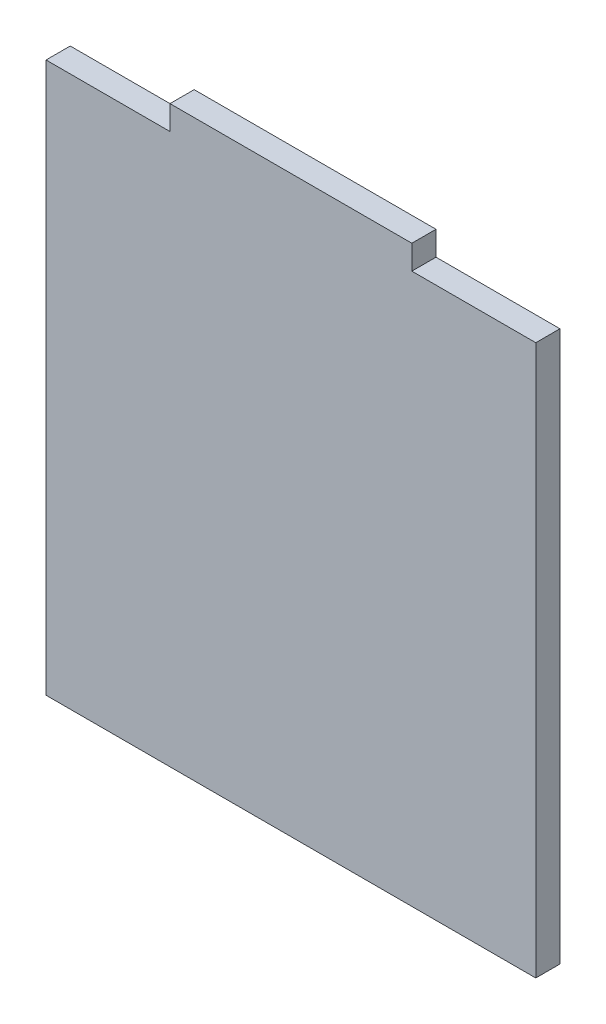
ISO-10303-21;
HEADER;
FILE_DESCRIPTION(('STEP AP214'),'2;1');
FILE_NAME('part.step','',(''),(''),'','','');
FILE_SCHEMA(('AUTOMOTIVE_DESIGN { 1 0 10303 214 1 1 1 1 }'));
ENDSEC;
DATA;
#1=APPLICATION_CONTEXT('core data for automotive mechanical design processes');
#2=APPLICATION_PROTOCOL_DEFINITION('international standard','automotive_design',2000,#1);
#3=PRODUCT_CONTEXT('',#1,'mechanical');
#4=PRODUCT('Part','Part','',(#3));
#5=PRODUCT_RELATED_PRODUCT_CATEGORY('part','',(#4));
#6=PRODUCT_DEFINITION_FORMATION('','',#4);
#7=PRODUCT_DEFINITION_CONTEXT('part definition',#1,'design');
#8=PRODUCT_DEFINITION('design','',#6,#7);
#9=PRODUCT_DEFINITION_SHAPE('','',#8);
#10=(LENGTH_UNIT() NAMED_UNIT(*) SI_UNIT(.MILLI.,.METRE.));
#11=(NAMED_UNIT(*) PLANE_ANGLE_UNIT() SI_UNIT($,.RADIAN.));
#12=(NAMED_UNIT(*) SI_UNIT($,.STERADIAN.) SOLID_ANGLE_UNIT());
#13=UNCERTAINTY_MEASURE_WITH_UNIT(LENGTH_MEASURE(1.E-05),#10,'distance_accuracy_value','');
#14=(GEOMETRIC_REPRESENTATION_CONTEXT(3) GLOBAL_UNCERTAINTY_ASSIGNED_CONTEXT((#13)) GLOBAL_UNIT_ASSIGNED_CONTEXT((#10,
#11,#12)) REPRESENTATION_CONTEXT('',''));
#15=CARTESIAN_POINT('',(0.,0.,0.));
#16=DIRECTION('',(0.,0.,1.));
#17=DIRECTION('',(1.,0.,0.));
#18=AXIS2_PLACEMENT_3D('',#15,#16,#17);
#19=CARTESIAN_POINT('',(-64.29375,72.23125,6.35));
#20=DIRECTION('',(0.,-1.,0.));
#21=DIRECTION('',(0.,0.,-1.));
#22=AXIS2_PLACEMENT_3D('',#19,#20,#21);
#23=PLANE('',#22);
#24=DIRECTION('',(0.,0.,1.));
#25=VECTOR('',#24,1.);
#26=CARTESIAN_POINT('',(-31.75,72.23125,0.));
#27=LINE('',#26,#25);
#28=CARTESIAN_POINT('',(-31.75,72.23125,0.));
#29=VERTEX_POINT('',#28);
#30=CARTESIAN_POINT('',(-31.75,72.23125,6.35));
#31=VERTEX_POINT('',#30);
#32=EDGE_CURVE('E120',#29,#31,#27,.T.);
#33=ORIENTED_EDGE('',*,*,#32,.F.);
#34=DIRECTION('',(-1.,0.,0.));
#35=VECTOR('',#34,1.);
#36=CARTESIAN_POINT('',(-64.29375,72.23125,0.));
#37=LINE('',#36,#35);
#38=CARTESIAN_POINT('',(-64.29375,72.23125,0.));
#39=VERTEX_POINT('',#38);
#40=EDGE_CURVE('E133',#29,#39,#37,.T.);
#41=ORIENTED_EDGE('',*,*,#40,.T.);
#42=DIRECTION('',(0.,0.,-1.));
#43=VECTOR('',#42,1.);
#44=CARTESIAN_POINT('',(-64.29375,72.23125,6.35));
#45=LINE('',#44,#43);
#46=CARTESIAN_POINT('',(-64.29375,72.23125,6.35));
#47=VERTEX_POINT('',#46);
#48=EDGE_CURVE('E51',#47,#39,#45,.T.);
#49=ORIENTED_EDGE('',*,*,#48,.F.);
#50=DIRECTION('',(-1.,0.,0.));
#51=VECTOR('',#50,1.);
#52=CARTESIAN_POINT('',(-64.29375,72.23125,6.35));
#53=LINE('',#52,#51);
#54=EDGE_CURVE('E135',#31,#47,#53,.T.);
#55=ORIENTED_EDGE('',*,*,#54,.F.);
#56=EDGE_LOOP('',(#33,#41,#49,#55));
#57=FACE_BOUND('',#56,.T.);
#58=ADVANCED_FACE('F43',(#57),#23,.F.);
#59=CARTESIAN_POINT('',(64.29375,-72.23125,6.35));
#60=DIRECTION('',(-1.,0.,0.));
#61=DIRECTION('',(0.,0.,1.));
#62=AXIS2_PLACEMENT_3D('',#59,#60,#61);
#63=PLANE('',#62);
#64=DIRECTION('',(0.,1.,0.));
#65=VECTOR('',#64,1.);
#66=CARTESIAN_POINT('',(64.29375,-72.23125,0.));
#67=LINE('',#66,#65);
#68=CARTESIAN_POINT('',(64.29375,-72.23125,0.));
#69=VERTEX_POINT('',#68);
#70=CARTESIAN_POINT('',(64.29375,72.23125,0.));
#71=VERTEX_POINT('',#70);
#72=EDGE_CURVE('E144',#69,#71,#67,.T.);
#73=ORIENTED_EDGE('',*,*,#72,.T.);
#74=DIRECTION('',(0.,0.,-1.));
#75=VECTOR('',#74,1.);
#76=CARTESIAN_POINT('',(64.29375,72.23125,6.35));
#77=LINE('',#76,#75);
#78=CARTESIAN_POINT('',(64.29375,72.23125,6.35));
#79=VERTEX_POINT('',#78);
#80=EDGE_CURVE('E11',#79,#71,#77,.T.);
#81=ORIENTED_EDGE('',*,*,#80,.F.);
#82=DIRECTION('',(0.,1.,0.));
#83=VECTOR('',#82,1.);
#84=CARTESIAN_POINT('',(64.29375,-72.23125,6.35));
#85=LINE('',#84,#83);
#86=CARTESIAN_POINT('',(64.29375,-72.23125,6.35));
#87=VERTEX_POINT('',#86);
#88=EDGE_CURVE('E153',#87,#79,#85,.T.);
#89=ORIENTED_EDGE('',*,*,#88,.F.);
#90=DIRECTION('',(0.,0.,-1.));
#91=VECTOR('',#90,1.);
#92=CARTESIAN_POINT('',(64.29375,-72.23125,6.35));
#93=LINE('',#92,#91);
#94=EDGE_CURVE('E154',#87,#69,#93,.T.);
#95=ORIENTED_EDGE('',*,*,#94,.T.);
#96=EDGE_LOOP('',(#73,#81,#89,#95));
#97=FACE_BOUND('',#96,.T.);
#98=ADVANCED_FACE('F45',(#97),#63,.F.);
#99=CARTESIAN_POINT('',(31.75,72.23125,0.));
#100=VERTEX_POINT('',#99);
#101=EDGE_CURVE('E143',#71,#100,#37,.T.);
#102=ORIENTED_EDGE('',*,*,#101,.T.);
#103=DIRECTION('',(0.,0.,1.));
#104=VECTOR('',#103,1.);
#105=CARTESIAN_POINT('',(31.75,72.23125,0.));
#106=LINE('',#105,#104);
#107=CARTESIAN_POINT('',(31.75,72.23125,6.35));
#108=VERTEX_POINT('',#107);
#109=EDGE_CURVE('E136',#100,#108,#106,.T.);
#110=ORIENTED_EDGE('',*,*,#109,.T.);
#111=EDGE_CURVE('E94',#79,#108,#53,.T.);
#112=ORIENTED_EDGE('',*,*,#111,.F.);
#113=ORIENTED_EDGE('',*,*,#80,.T.);
#114=EDGE_LOOP('',(#102,#110,#112,#113));
#115=FACE_BOUND('',#114,.T.);
#116=ADVANCED_FACE('F186',(#115),#23,.F.);
#117=CARTESIAN_POINT('',(-64.29375,-72.23125,6.35));
#118=DIRECTION('',(1.,0.,0.));
#119=DIRECTION('',(0.,0.,-1.));
#120=AXIS2_PLACEMENT_3D('',#117,#118,#119);
#121=PLANE('',#120);
#122=DIRECTION('',(0.,-1.,0.));
#123=VECTOR('',#122,1.);
#124=CARTESIAN_POINT('',(-64.29375,-72.23125,0.));
#125=LINE('',#124,#123);
#126=CARTESIAN_POINT('',(-64.29375,-72.23125,0.));
#127=VERTEX_POINT('',#126);
#128=EDGE_CURVE('E142',#39,#127,#125,.T.);
#129=ORIENTED_EDGE('',*,*,#128,.T.);
#130=DIRECTION('',(0.,0.,-1.));
#131=VECTOR('',#130,1.);
#132=CARTESIAN_POINT('',(-64.29375,-72.23125,6.35));
#133=LINE('',#132,#131);
#134=CARTESIAN_POINT('',(-64.29375,-72.23125,6.35));
#135=VERTEX_POINT('',#134);
#136=EDGE_CURVE('E156',#135,#127,#133,.T.);
#137=ORIENTED_EDGE('',*,*,#136,.F.);
#138=DIRECTION('',(0.,-1.,0.));
#139=VECTOR('',#138,1.);
#140=CARTESIAN_POINT('',(-64.29375,-72.23125,6.35));
#141=LINE('',#140,#139);
#142=EDGE_CURVE('E161',#47,#135,#141,.T.);
#143=ORIENTED_EDGE('',*,*,#142,.F.);
#144=ORIENTED_EDGE('',*,*,#48,.T.);
#145=EDGE_LOOP('',(#129,#137,#143,#144));
#146=FACE_BOUND('',#145,.T.);
#147=ADVANCED_FACE('F159',(#146),#121,.F.);
#148=CARTESIAN_POINT('',(-64.29375,-72.23125,6.35));
#149=DIRECTION('',(0.,1.,0.));
#150=DIRECTION('',(0.,0.,1.));
#151=AXIS2_PLACEMENT_3D('',#148,#149,#150);
#152=PLANE('',#151);
#153=DIRECTION('',(1.,0.,0.));
#154=VECTOR('',#153,1.);
#155=CARTESIAN_POINT('',(-64.29375,-72.23125,0.));
#156=LINE('',#155,#154);
#157=EDGE_CURVE('E88',#127,#69,#156,.T.);
#158=ORIENTED_EDGE('',*,*,#157,.T.);
#159=ORIENTED_EDGE('',*,*,#94,.F.);
#160=DIRECTION('',(1.,0.,0.));
#161=VECTOR('',#160,1.);
#162=CARTESIAN_POINT('',(-64.29375,-72.23125,6.35));
#163=LINE('',#162,#161);
#164=EDGE_CURVE('E67',#135,#87,#163,.T.);
#165=ORIENTED_EDGE('',*,*,#164,.F.);
#166=ORIENTED_EDGE('',*,*,#136,.T.);
#167=EDGE_LOOP('',(#158,#159,#165,#166));
#168=FACE_BOUND('',#167,.T.);
#169=ADVANCED_FACE('F193',(#168),#152,.F.);
#170=CARTESIAN_POINT('',(0.,0.,6.35));
#171=DIRECTION('',(0.,0.,-1.));
#172=DIRECTION('',(-1.,0.,0.));
#173=AXIS2_PLACEMENT_3D('',#170,#171,#172);
#174=PLANE('',#173);
#175=ORIENTED_EDGE('',*,*,#88,.T.);
#176=ORIENTED_EDGE('',*,*,#111,.T.);
#177=DIRECTION('',(0.,1.,0.));
#178=VECTOR('',#177,1.);
#179=CARTESIAN_POINT('',(31.75,72.23125,6.35));
#180=LINE('',#179,#178);
#181=CARTESIAN_POINT('',(31.75,78.58125,6.35));
#182=VERTEX_POINT('',#181);
#183=EDGE_CURVE('E58',#108,#182,#180,.T.);
#184=ORIENTED_EDGE('',*,*,#183,.T.);
#185=DIRECTION('',(-1.,0.,0.));
#186=VECTOR('',#185,1.);
#187=CARTESIAN_POINT('',(-31.75,78.58125,6.35));
#188=LINE('',#187,#186);
#189=CARTESIAN_POINT('',(-31.75,78.58125,6.35));
#190=VERTEX_POINT('',#189);
#191=EDGE_CURVE('E128',#182,#190,#188,.T.);
#192=ORIENTED_EDGE('',*,*,#191,.T.);
#193=DIRECTION('',(0.,-1.,0.));
#194=VECTOR('',#193,1.);
#195=CARTESIAN_POINT('',(-31.75,72.23125,6.35));
#196=LINE('',#195,#194);
#197=EDGE_CURVE('E173',#190,#31,#196,.T.);
#198=ORIENTED_EDGE('',*,*,#197,.T.);
#199=ORIENTED_EDGE('',*,*,#54,.T.);
#200=ORIENTED_EDGE('',*,*,#142,.T.);
#201=ORIENTED_EDGE('',*,*,#164,.T.);
#202=EDGE_LOOP('',(#175,#176,#184,#192,#198,#199,#200,#201));
#203=FACE_BOUND('',#202,.T.);
#204=ADVANCED_FACE('F182',(#203),#174,.F.);
#205=CARTESIAN_POINT('',(0.,0.,0.));
#206=DIRECTION('',(0.,0.,-1.));
#207=DIRECTION('',(-1.,0.,0.));
#208=AXIS2_PLACEMENT_3D('',#205,#206,#207);
#209=PLANE('',#208);
#210=ORIENTED_EDGE('',*,*,#72,.F.);
#211=ORIENTED_EDGE('',*,*,#157,.F.);
#212=ORIENTED_EDGE('',*,*,#128,.F.);
#213=ORIENTED_EDGE('',*,*,#40,.F.);
#214=DIRECTION('',(0.,-1.,0.));
#215=VECTOR('',#214,1.);
#216=CARTESIAN_POINT('',(-31.75,72.23125,0.));
#217=LINE('',#216,#215);
#218=CARTESIAN_POINT('',(-31.75,78.58125,0.));
#219=VERTEX_POINT('',#218);
#220=EDGE_CURVE('E116',#219,#29,#217,.T.);
#221=ORIENTED_EDGE('',*,*,#220,.F.);
#222=DIRECTION('',(-1.,0.,0.));
#223=VECTOR('',#222,1.);
#224=CARTESIAN_POINT('',(-31.75,78.58125,0.));
#225=LINE('',#224,#223);
#226=CARTESIAN_POINT('',(31.75,78.58125,0.));
#227=VERTEX_POINT('',#226);
#228=EDGE_CURVE('E137',#227,#219,#225,.T.);
#229=ORIENTED_EDGE('',*,*,#228,.F.);
#230=DIRECTION('',(0.,1.,0.));
#231=VECTOR('',#230,1.);
#232=CARTESIAN_POINT('',(31.75,72.23125,0.));
#233=LINE('',#232,#231);
#234=EDGE_CURVE('E127',#100,#227,#233,.T.);
#235=ORIENTED_EDGE('',*,*,#234,.F.);
#236=ORIENTED_EDGE('',*,*,#101,.F.);
#237=EDGE_LOOP('',(#210,#211,#212,#213,#221,#229,#235,#236));
#238=FACE_BOUND('',#237,.T.);
#239=ADVANCED_FACE('F141',(#238),#209,.T.);
#240=CARTESIAN_POINT('',(-31.75,72.23125,0.));
#241=DIRECTION('',(-1.,0.,0.));
#242=DIRECTION('',(0.,0.,1.));
#243=AXIS2_PLACEMENT_3D('',#240,#241,#242);
#244=PLANE('',#243);
#245=ORIENTED_EDGE('',*,*,#197,.F.);
#246=DIRECTION('',(0.,0.,1.));
#247=VECTOR('',#246,1.);
#248=CARTESIAN_POINT('',(-31.75,78.58125,0.));
#249=LINE('',#248,#247);
#250=EDGE_CURVE('E122',#219,#190,#249,.T.);
#251=ORIENTED_EDGE('',*,*,#250,.F.);
#252=ORIENTED_EDGE('',*,*,#220,.T.);
#253=ORIENTED_EDGE('',*,*,#32,.T.);
#254=EDGE_LOOP('',(#245,#251,#252,#253));
#255=FACE_BOUND('',#254,.T.);
#256=ADVANCED_FACE('F119',(#255),#244,.T.);
#257=CARTESIAN_POINT('',(-31.75,78.58125,0.));
#258=DIRECTION('',(0.,1.,0.));
#259=DIRECTION('',(0.,0.,1.));
#260=AXIS2_PLACEMENT_3D('',#257,#258,#259);
#261=PLANE('',#260);
#262=ORIENTED_EDGE('',*,*,#191,.F.);
#263=DIRECTION('',(0.,0.,1.));
#264=VECTOR('',#263,1.);
#265=CARTESIAN_POINT('',(31.75,78.58125,0.));
#266=LINE('',#265,#264);
#267=EDGE_CURVE('E167',#227,#182,#266,.T.);
#268=ORIENTED_EDGE('',*,*,#267,.F.);
#269=ORIENTED_EDGE('',*,*,#228,.T.);
#270=ORIENTED_EDGE('',*,*,#250,.T.);
#271=EDGE_LOOP('',(#262,#268,#269,#270));
#272=FACE_BOUND('',#271,.T.);
#273=ADVANCED_FACE('F181',(#272),#261,.T.);
#274=CARTESIAN_POINT('',(31.75,72.23125,0.));
#275=DIRECTION('',(1.,0.,0.));
#276=DIRECTION('',(0.,0.,-1.));
#277=AXIS2_PLACEMENT_3D('',#274,#275,#276);
#278=PLANE('',#277);
#279=ORIENTED_EDGE('',*,*,#183,.F.);
#280=ORIENTED_EDGE('',*,*,#109,.F.);
#281=ORIENTED_EDGE('',*,*,#234,.T.);
#282=ORIENTED_EDGE('',*,*,#267,.T.);
#283=EDGE_LOOP('',(#279,#280,#281,#282));
#284=FACE_BOUND('',#283,.T.);
#285=ADVANCED_FACE('F178',(#284),#278,.T.);
#286=CLOSED_SHELL('',(#58,#98,#116,#147,#169,#204,#239,#256,#273,#285));
#287=MANIFOLD_SOLID_BREP('B2',#286);
#288=ADVANCED_BREP_SHAPE_REPRESENTATION('',(#18,#287),#14);
#289=SHAPE_DEFINITION_REPRESENTATION(#9,#288);
ENDSEC;
END-ISO-10303-21;
